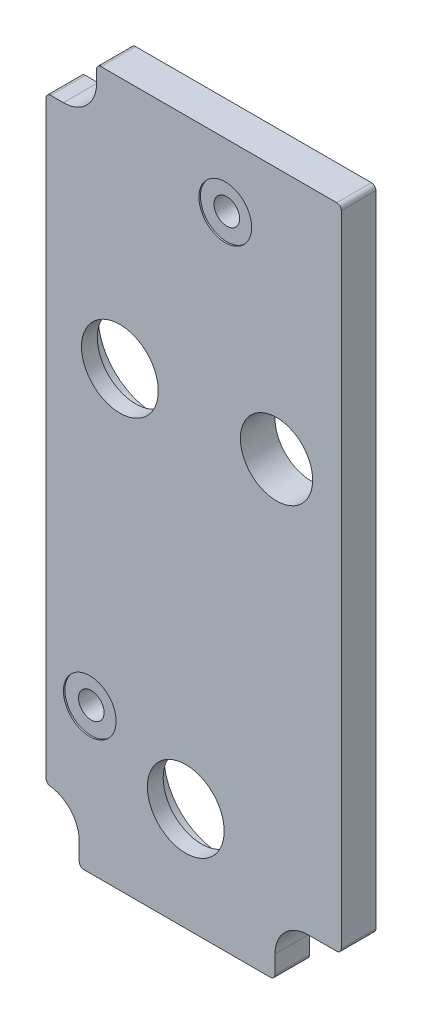
ISO-10303-21;
HEADER;
FILE_DESCRIPTION(('STEP AP214'),'2;1');
FILE_NAME('part.step','',(''),(''),'','','');
FILE_SCHEMA(('AUTOMOTIVE_DESIGN { 1 0 10303 214 1 1 1 1 }'));
ENDSEC;
DATA;
#1=APPLICATION_CONTEXT('core data for automotive mechanical design processes');
#2=APPLICATION_PROTOCOL_DEFINITION('international standard','automotive_design',2000,#1);
#3=PRODUCT_CONTEXT('',#1,'mechanical');
#4=PRODUCT('Part','Part','',(#3));
#5=PRODUCT_RELATED_PRODUCT_CATEGORY('part','',(#4));
#6=PRODUCT_DEFINITION_FORMATION('','',#4);
#7=PRODUCT_DEFINITION_CONTEXT('part definition',#1,'design');
#8=PRODUCT_DEFINITION('design','',#6,#7);
#9=PRODUCT_DEFINITION_SHAPE('','',#8);
#10=(LENGTH_UNIT() NAMED_UNIT(*) SI_UNIT(.MILLI.,.METRE.));
#11=(NAMED_UNIT(*) PLANE_ANGLE_UNIT() SI_UNIT($,.RADIAN.));
#12=(NAMED_UNIT(*) SI_UNIT($,.STERADIAN.) SOLID_ANGLE_UNIT());
#13=UNCERTAINTY_MEASURE_WITH_UNIT(LENGTH_MEASURE(1.E-05),#10,'distance_accuracy_value','');
#14=(GEOMETRIC_REPRESENTATION_CONTEXT(3) GLOBAL_UNCERTAINTY_ASSIGNED_CONTEXT((#13)) GLOBAL_UNIT_ASSIGNED_CONTEXT((#10,
#11,#12)) REPRESENTATION_CONTEXT('',''));
#15=CARTESIAN_POINT('',(0.,0.,0.));
#16=DIRECTION('',(0.,0.,1.));
#17=DIRECTION('',(1.,0.,0.));
#18=AXIS2_PLACEMENT_3D('',#15,#16,#17);
#19=CARTESIAN_POINT('',(-43.18,37.084,7.4295));
#20=DIRECTION('',(0.,0.,-1.));
#21=DIRECTION('',(-1.,0.,0.));
#22=AXIS2_PLACEMENT_3D('',#19,#20,#21);
#23=CYLINDRICAL_SURFACE('',#22,2.15900000000001);
#24=CARTESIAN_POINT('',(-43.18,37.084,1.5875));
#25=DIRECTION('',(0.,0.,-1.));
#26=DIRECTION('',(-1.,0.,0.));
#27=AXIS2_PLACEMENT_3D('',#24,#25,#26);
#28=CIRCLE('',#27,2.15900000000001);
#29=CARTESIAN_POINT('',(-45.339,37.084,1.5875));
#30=VERTEX_POINT('',#29);
#31=EDGE_CURVE('E247',#30,#30,#28,.T.);
#32=ORIENTED_EDGE('',*,*,#31,.T.);
#33=EDGE_LOOP('',(#32));
#34=FACE_BOUND('',#33,.T.);
#35=CARTESIAN_POINT('',(-43.18,37.084,7.1755));
#36=DIRECTION('',(0.,0.,-1.));
#37=DIRECTION('',(-1.,0.,0.));
#38=AXIS2_PLACEMENT_3D('',#35,#36,#37);
#39=CIRCLE('',#38,2.15900000000001);
#40=CARTESIAN_POINT('',(-45.339,37.084,7.1755));
#41=VERTEX_POINT('',#40);
#42=EDGE_CURVE('E279',#41,#41,#39,.T.);
#43=ORIENTED_EDGE('',*,*,#42,.F.);
#44=EDGE_LOOP('',(#43));
#45=FACE_BOUND('',#44,.T.);
#46=ADVANCED_FACE('F17',(#34,#45),#23,.F.);
#47=CARTESIAN_POINT('',(-20.32,120.65,7.4295));
#48=DIRECTION('',(0.,0.,-1.));
#49=DIRECTION('',(-1.,0.,0.));
#50=AXIS2_PLACEMENT_3D('',#47,#48,#49);
#51=CYLINDRICAL_SURFACE('',#50,2.159);
#52=CARTESIAN_POINT('',(-20.32,120.65,1.5875));
#53=DIRECTION('',(0.,0.,-1.));
#54=DIRECTION('',(-1.,0.,0.));
#55=AXIS2_PLACEMENT_3D('',#52,#53,#54);
#56=CIRCLE('',#55,2.159);
#57=CARTESIAN_POINT('',(-22.479,120.65,1.5875));
#58=VERTEX_POINT('',#57);
#59=EDGE_CURVE('E244',#58,#58,#56,.T.);
#60=ORIENTED_EDGE('',*,*,#59,.T.);
#61=EDGE_LOOP('',(#60));
#62=FACE_BOUND('',#61,.T.);
#63=CARTESIAN_POINT('',(-20.32,120.65,7.1755));
#64=DIRECTION('',(0.,0.,-1.));
#65=DIRECTION('',(-1.,0.,0.));
#66=AXIS2_PLACEMENT_3D('',#63,#64,#65);
#67=CIRCLE('',#66,2.159);
#68=CARTESIAN_POINT('',(-22.479,120.65,7.1755));
#69=VERTEX_POINT('',#68);
#70=EDGE_CURVE('E276',#69,#69,#67,.T.);
#71=ORIENTED_EDGE('',*,*,#70,.F.);
#72=EDGE_LOOP('',(#71));
#73=FACE_BOUND('',#72,.T.);
#74=ADVANCED_FACE('F685',(#62,#73),#51,.F.);
#75=CARTESIAN_POINT('',(-38.1,88.9,1.5875));
#76=DIRECTION('',(0.,0.,1.));
#77=DIRECTION('',(1.,0.,0.));
#78=AXIS2_PLACEMENT_3D('',#75,#76,#77);
#79=CYLINDRICAL_SURFACE('',#78,9.525);
#80=CARTESIAN_POINT('',(-38.1,88.9,4.7625));
#81=DIRECTION('',(0.,0.,1.));
#82=DIRECTION('',(1.,0.,0.));
#83=AXIS2_PLACEMENT_3D('',#80,#81,#82);
#84=CIRCLE('',#83,9.525);
#85=CARTESIAN_POINT('',(-28.575,88.9,4.7625));
#86=VERTEX_POINT('',#85);
#87=EDGE_CURVE('E270',#86,#86,#84,.F.);
#88=ORIENTED_EDGE('',*,*,#87,.F.);
#89=EDGE_LOOP('',(#88));
#90=FACE_BOUND('',#89,.T.);
#91=CARTESIAN_POINT('',(-38.1,88.9,1.5875));
#92=DIRECTION('',(0.,0.,1.));
#93=DIRECTION('',(1.,0.,0.));
#94=AXIS2_PLACEMENT_3D('',#91,#92,#93);
#95=CIRCLE('',#94,9.525);
#96=CARTESIAN_POINT('',(-28.575,88.9,1.5875));
#97=VERTEX_POINT('',#96);
#98=EDGE_CURVE('E241',#97,#97,#95,.F.);
#99=ORIENTED_EDGE('',*,*,#98,.T.);
#100=EDGE_LOOP('',(#99));
#101=FACE_BOUND('',#100,.T.);
#102=ADVANCED_FACE('F676',(#90,#101),#79,.F.);
#103=CARTESIAN_POINT('',(-26.9875,30.1625,1.5875));
#104=DIRECTION('',(0.,0.,1.));
#105=DIRECTION('',(1.,0.,0.));
#106=AXIS2_PLACEMENT_3D('',#103,#104,#105);
#107=CYLINDRICAL_SURFACE('',#106,9.525);
#108=CARTESIAN_POINT('',(-26.9875,30.1625,4.7625));
#109=DIRECTION('',(0.,0.,1.));
#110=DIRECTION('',(1.,0.,0.));
#111=AXIS2_PLACEMENT_3D('',#108,#109,#110);
#112=CIRCLE('',#111,9.525);
#113=CARTESIAN_POINT('',(-17.4625,30.1625,4.7625));
#114=VERTEX_POINT('',#113);
#115=EDGE_CURVE('E273',#114,#114,#112,.F.);
#116=ORIENTED_EDGE('',*,*,#115,.F.);
#117=EDGE_LOOP('',(#116));
#118=FACE_BOUND('',#117,.T.);
#119=CARTESIAN_POINT('',(-26.9875,30.1625,1.5875));
#120=DIRECTION('',(0.,0.,1.));
#121=DIRECTION('',(1.,0.,0.));
#122=AXIS2_PLACEMENT_3D('',#119,#120,#121);
#123=CIRCLE('',#122,9.525);
#124=CARTESIAN_POINT('',(-17.4625,30.1625,1.5875));
#125=VERTEX_POINT('',#124);
#126=EDGE_CURVE('E178',#125,#125,#123,.F.);
#127=ORIENTED_EDGE('',*,*,#126,.T.);
#128=EDGE_LOOP('',(#127));
#129=FACE_BOUND('',#128,.T.);
#130=ADVANCED_FACE('F668',(#118,#129),#107,.F.);
#131=CARTESIAN_POINT('',(-41.275,130.683,1.5875));
#132=DIRECTION('',(0.,0.,1.));
#133=DIRECTION('',(1.,0.,0.));
#134=AXIS2_PLACEMENT_3D('',#131,#132,#133);
#135=CYLINDRICAL_SURFACE('',#134,0.762);
#136=CARTESIAN_POINT('',(-41.275,130.683,1.5875));
#137=DIRECTION('',(0.,0.,1.));
#138=DIRECTION('',(1.,0.,0.));
#139=AXIS2_PLACEMENT_3D('',#136,#137,#138);
#140=CIRCLE('',#139,0.762);
#141=CARTESIAN_POINT('',(-41.275,131.445,1.5875));
#142=VERTEX_POINT('',#141);
#143=CARTESIAN_POINT('',(-42.037,130.683,1.5875));
#144=VERTEX_POINT('',#143);
#145=EDGE_CURVE('E268',#142,#144,#140,.T.);
#146=ORIENTED_EDGE('',*,*,#145,.T.);
#147=DIRECTION('',(0.,0.,1.));
#148=VECTOR('',#147,1.);
#149=CARTESIAN_POINT('',(-42.037,130.683,1.5875));
#150=LINE('',#149,#148);
#151=CARTESIAN_POINT('',(-42.037,130.683,7.4295));
#152=VERTEX_POINT('',#151);
#153=EDGE_CURVE('E94',#152,#144,#150,.F.);
#154=ORIENTED_EDGE('',*,*,#153,.F.);
#155=CARTESIAN_POINT('',(-41.275,130.683,7.4295));
#156=DIRECTION('',(0.,0.,1.));
#157=DIRECTION('',(1.,0.,0.));
#158=AXIS2_PLACEMENT_3D('',#155,#156,#157);
#159=CIRCLE('',#158,0.762);
#160=CARTESIAN_POINT('',(-41.275,131.445,7.4295));
#161=VERTEX_POINT('',#160);
#162=EDGE_CURVE('E20',#152,#161,#159,.F.);
#163=ORIENTED_EDGE('',*,*,#162,.T.);
#164=DIRECTION('',(0.,0.,1.));
#165=VECTOR('',#164,1.);
#166=CARTESIAN_POINT('',(-41.275,131.445,1.5875));
#167=LINE('',#166,#165);
#168=EDGE_CURVE('E91',#142,#161,#167,.T.);
#169=ORIENTED_EDGE('',*,*,#168,.F.);
#170=EDGE_LOOP('',(#146,#154,#163,#169));
#171=FACE_BOUND('',#170,.T.);
#172=ADVANCED_FACE('F89',(#171),#135,.T.);
#173=CARTESIAN_POINT('',(-49.784,122.2375,1.5875));
#174=DIRECTION('',(0.,0.,1.));
#175=DIRECTION('',(1.,0.,0.));
#176=AXIS2_PLACEMENT_3D('',#173,#174,#175);
#177=CYLINDRICAL_SURFACE('',#176,0.762);
#178=CARTESIAN_POINT('',(-49.784,122.2375,1.5875));
#179=DIRECTION('',(0.,0.,1.));
#180=DIRECTION('',(1.,0.,0.));
#181=AXIS2_PLACEMENT_3D('',#178,#179,#180);
#182=CIRCLE('',#181,0.762);
#183=CARTESIAN_POINT('',(-49.784,122.9995,1.5875));
#184=VERTEX_POINT('',#183);
#185=CARTESIAN_POINT('',(-50.546,122.2375,1.5875));
#186=VERTEX_POINT('',#185);
#187=EDGE_CURVE('E265',#184,#186,#182,.T.);
#188=ORIENTED_EDGE('',*,*,#187,.T.);
#189=DIRECTION('',(0.,0.,1.));
#190=VECTOR('',#189,1.);
#191=CARTESIAN_POINT('',(-50.546,122.2375,1.5875));
#192=LINE('',#191,#190);
#193=CARTESIAN_POINT('',(-50.546,122.2375,7.4295));
#194=VERTEX_POINT('',#193);
#195=EDGE_CURVE('E158',#194,#186,#192,.F.);
#196=ORIENTED_EDGE('',*,*,#195,.F.);
#197=CARTESIAN_POINT('',(-49.784,122.2375,7.4295));
#198=DIRECTION('',(0.,0.,1.));
#199=DIRECTION('',(1.,0.,0.));
#200=AXIS2_PLACEMENT_3D('',#197,#198,#199);
#201=CIRCLE('',#200,0.762);
#202=CARTESIAN_POINT('',(-49.784,122.9995,7.4295));
#203=VERTEX_POINT('',#202);
#204=EDGE_CURVE('E96',#194,#203,#201,.F.);
#205=ORIENTED_EDGE('',*,*,#204,.T.);
#206=DIRECTION('',(0.,0.,1.));
#207=VECTOR('',#206,1.);
#208=CARTESIAN_POINT('',(-49.784,122.9995,1.5875));
#209=LINE('',#208,#207);
#210=EDGE_CURVE('E169',#184,#203,#209,.T.);
#211=ORIENTED_EDGE('',*,*,#210,.F.);
#212=EDGE_LOOP('',(#188,#196,#205,#211));
#213=FACE_BOUND('',#212,.T.);
#214=ADVANCED_FACE('F292',(#213),#177,.T.);
#215=CARTESIAN_POINT('',(-49.784,22.8141142121634,1.5875));
#216=DIRECTION('',(0.,0.,1.));
#217=DIRECTION('',(1.,0.,0.));
#218=AXIS2_PLACEMENT_3D('',#215,#216,#217);
#219=CYLINDRICAL_SURFACE('',#218,0.762);
#220=CARTESIAN_POINT('',(-49.784,22.8141142121634,1.5875));
#221=DIRECTION('',(0.,0.,1.));
#222=DIRECTION('',(1.,0.,0.));
#223=AXIS2_PLACEMENT_3D('',#220,#221,#222);
#224=CIRCLE('',#223,0.762);
#225=CARTESIAN_POINT('',(-50.546,22.8141142121634,1.5875));
#226=VERTEX_POINT('',#225);
#227=CARTESIAN_POINT('',(-49.87544,22.0576205067037,1.5875));
#228=VERTEX_POINT('',#227);
#229=EDGE_CURVE('E262',#226,#228,#224,.T.);
#230=ORIENTED_EDGE('',*,*,#229,.T.);
#231=DIRECTION('',(0.,0.,1.));
#232=VECTOR('',#231,1.);
#233=CARTESIAN_POINT('',(-49.87544,22.0576205067038,1.5875));
#234=LINE('',#233,#232);
#235=CARTESIAN_POINT('',(-49.87544,22.0576205067037,7.4295));
#236=VERTEX_POINT('',#235);
#237=EDGE_CURVE('E154',#228,#236,#234,.T.);
#238=ORIENTED_EDGE('',*,*,#237,.T.);
#239=CARTESIAN_POINT('',(-49.784,22.8141142121634,7.4295));
#240=DIRECTION('',(0.,0.,1.));
#241=DIRECTION('',(1.,0.,0.));
#242=AXIS2_PLACEMENT_3D('',#239,#240,#241);
#243=CIRCLE('',#242,0.762);
#244=CARTESIAN_POINT('',(-50.546,22.8141142121634,7.4295));
#245=VERTEX_POINT('',#244);
#246=EDGE_CURVE('E288',#236,#245,#243,.F.);
#247=ORIENTED_EDGE('',*,*,#246,.T.);
#248=DIRECTION('',(0.,0.,1.));
#249=VECTOR('',#248,1.);
#250=CARTESIAN_POINT('',(-50.546,22.8141142121634,1.5875));
#251=LINE('',#250,#249);
#252=EDGE_CURVE('E163',#226,#245,#251,.T.);
#253=ORIENTED_EDGE('',*,*,#252,.F.);
#254=EDGE_LOOP('',(#230,#238,#247,#253));
#255=FACE_BOUND('',#254,.T.);
#256=ADVANCED_FACE('F409',(#255),#219,.T.);
#257=CARTESIAN_POINT('',(-44.196,13.462,1.5875));
#258=DIRECTION('',(0.,0.,1.));
#259=DIRECTION('',(1.,0.,0.));
#260=AXIS2_PLACEMENT_3D('',#257,#258,#259);
#261=CYLINDRICAL_SURFACE('',#260,0.762);
#262=CARTESIAN_POINT('',(-44.196,13.462,1.5875));
#263=DIRECTION('',(0.,0.,1.));
#264=DIRECTION('',(1.,0.,0.));
#265=AXIS2_PLACEMENT_3D('',#262,#263,#264);
#266=CIRCLE('',#265,0.762);
#267=CARTESIAN_POINT('',(-44.958,13.462,1.5875));
#268=VERTEX_POINT('',#267);
#269=CARTESIAN_POINT('',(-44.196,12.7,1.5875));
#270=VERTEX_POINT('',#269);
#271=EDGE_CURVE('E259',#268,#270,#266,.T.);
#272=ORIENTED_EDGE('',*,*,#271,.T.);
#273=DIRECTION('',(0.,0.,1.));
#274=VECTOR('',#273,1.);
#275=CARTESIAN_POINT('',(-44.196,12.7,1.5875));
#276=LINE('',#275,#274);
#277=CARTESIAN_POINT('',(-44.196,12.7,7.4295));
#278=VERTEX_POINT('',#277);
#279=EDGE_CURVE('E141',#278,#270,#276,.F.);
#280=ORIENTED_EDGE('',*,*,#279,.F.);
#281=CARTESIAN_POINT('',(-44.196,13.462,7.4295));
#282=DIRECTION('',(0.,0.,1.));
#283=DIRECTION('',(1.,0.,0.));
#284=AXIS2_PLACEMENT_3D('',#281,#282,#283);
#285=CIRCLE('',#284,0.762);
#286=CARTESIAN_POINT('',(-44.958,13.462,7.4295));
#287=VERTEX_POINT('',#286);
#288=EDGE_CURVE('E286',#278,#287,#285,.F.);
#289=ORIENTED_EDGE('',*,*,#288,.T.);
#290=DIRECTION('',(0.,0.,1.));
#291=VECTOR('',#290,1.);
#292=CARTESIAN_POINT('',(-44.958,13.462,1.5875));
#293=LINE('',#292,#291);
#294=EDGE_CURVE('E151',#268,#287,#293,.T.);
#295=ORIENTED_EDGE('',*,*,#294,.F.);
#296=EDGE_LOOP('',(#272,#280,#289,#295));
#297=FACE_BOUND('',#296,.T.);
#298=ADVANCED_FACE('F397',(#297),#261,.T.);
#299=CARTESIAN_POINT('',(-12.7,13.462,1.5875));
#300=DIRECTION('',(0.,0.,1.));
#301=DIRECTION('',(1.,0.,0.));
#302=AXIS2_PLACEMENT_3D('',#299,#300,#301);
#303=CYLINDRICAL_SURFACE('',#302,0.762);
#304=CARTESIAN_POINT('',(-12.7,13.462,1.5875));
#305=DIRECTION('',(0.,0.,1.));
#306=DIRECTION('',(1.,0.,0.));
#307=AXIS2_PLACEMENT_3D('',#304,#305,#306);
#308=CIRCLE('',#307,0.762);
#309=CARTESIAN_POINT('',(-12.7,12.7,1.5875));
#310=VERTEX_POINT('',#309);
#311=CARTESIAN_POINT('',(-11.938,13.462,1.5875));
#312=VERTEX_POINT('',#311);
#313=EDGE_CURVE('E256',#310,#312,#308,.T.);
#314=ORIENTED_EDGE('',*,*,#313,.T.);
#315=DIRECTION('',(0.,0.,1.));
#316=VECTOR('',#315,1.);
#317=CARTESIAN_POINT('',(-11.938,13.462,1.5875));
#318=LINE('',#317,#316);
#319=CARTESIAN_POINT('',(-11.938,13.462,7.4295));
#320=VERTEX_POINT('',#319);
#321=EDGE_CURVE('E137',#320,#312,#318,.F.);
#322=ORIENTED_EDGE('',*,*,#321,.F.);
#323=CARTESIAN_POINT('',(-12.7,13.462,7.4295));
#324=DIRECTION('',(0.,0.,1.));
#325=DIRECTION('',(1.,0.,0.));
#326=AXIS2_PLACEMENT_3D('',#323,#324,#325);
#327=CIRCLE('',#326,0.762);
#328=CARTESIAN_POINT('',(-12.7,12.7,7.4295));
#329=VERTEX_POINT('',#328);
#330=EDGE_CURVE('E284',#320,#329,#327,.F.);
#331=ORIENTED_EDGE('',*,*,#330,.T.);
#332=DIRECTION('',(0.,0.,1.));
#333=VECTOR('',#332,1.);
#334=CARTESIAN_POINT('',(-12.7,12.7,1.5875));
#335=LINE('',#334,#333);
#336=EDGE_CURVE('E140',#310,#329,#335,.T.);
#337=ORIENTED_EDGE('',*,*,#336,.F.);
#338=EDGE_LOOP('',(#314,#322,#331,#337));
#339=FACE_BOUND('',#338,.T.);
#340=ADVANCED_FACE('F389',(#339),#303,.T.);
#341=CARTESIAN_POINT('',(-1.52399999999998,130.683,1.5875));
#342=DIRECTION('',(0.,0.,1.));
#343=DIRECTION('',(1.,0.,0.));
#344=AXIS2_PLACEMENT_3D('',#341,#342,#343);
#345=CYLINDRICAL_SURFACE('',#344,0.762);
#346=CARTESIAN_POINT('',(-1.52399999999998,130.683,1.5875));
#347=DIRECTION('',(0.,0.,1.));
#348=DIRECTION('',(1.,0.,0.));
#349=AXIS2_PLACEMENT_3D('',#346,#347,#348);
#350=CIRCLE('',#349,0.762);
#351=CARTESIAN_POINT('',(-0.761999999999984,130.683,1.5875));
#352=VERTEX_POINT('',#351);
#353=CARTESIAN_POINT('',(-1.52399999999998,131.445,1.5875));
#354=VERTEX_POINT('',#353);
#355=EDGE_CURVE('E250',#352,#354,#350,.T.);
#356=ORIENTED_EDGE('',*,*,#355,.T.);
#357=DIRECTION('',(0.,0.,1.));
#358=VECTOR('',#357,1.);
#359=CARTESIAN_POINT('',(-1.52399999999998,131.445,1.5875));
#360=LINE('',#359,#358);
#361=CARTESIAN_POINT('',(-1.52399999999998,131.445,7.4295));
#362=VERTEX_POINT('',#361);
#363=EDGE_CURVE('E177',#362,#354,#360,.F.);
#364=ORIENTED_EDGE('',*,*,#363,.F.);
#365=CARTESIAN_POINT('',(-1.52399999999998,130.683,7.4295));
#366=DIRECTION('',(0.,0.,1.));
#367=DIRECTION('',(1.,0.,0.));
#368=AXIS2_PLACEMENT_3D('',#365,#366,#367);
#369=CIRCLE('',#368,0.762);
#370=CARTESIAN_POINT('',(-0.761999999999991,130.683,7.4295));
#371=VERTEX_POINT('',#370);
#372=EDGE_CURVE('E106',#362,#371,#369,.F.);
#373=ORIENTED_EDGE('',*,*,#372,.T.);
#374=DIRECTION('',(0.,0.,1.));
#375=VECTOR('',#374,1.);
#376=CARTESIAN_POINT('',(-0.761999999999984,130.683,1.5875));
#377=LINE('',#376,#375);
#378=EDGE_CURVE('E122',#352,#371,#377,.T.);
#379=ORIENTED_EDGE('',*,*,#378,.F.);
#380=EDGE_LOOP('',(#356,#364,#373,#379));
#381=FACE_BOUND('',#380,.T.);
#382=ADVANCED_FACE('F321',(#381),#345,.T.);
#383=CARTESIAN_POINT('',(-1.524,22.86,1.5875));
#384=DIRECTION('',(0.,0.,1.));
#385=DIRECTION('',(1.,0.,0.));
#386=AXIS2_PLACEMENT_3D('',#383,#384,#385);
#387=CYLINDRICAL_SURFACE('',#386,0.762);
#388=CARTESIAN_POINT('',(-1.524,22.86,1.5875));
#389=DIRECTION('',(0.,0.,1.));
#390=DIRECTION('',(1.,0.,0.));
#391=AXIS2_PLACEMENT_3D('',#388,#389,#390);
#392=CIRCLE('',#391,0.762);
#393=CARTESIAN_POINT('',(-1.524,22.098,1.5875));
#394=VERTEX_POINT('',#393);
#395=CARTESIAN_POINT('',(-0.761999999999997,22.86,1.5875));
#396=VERTEX_POINT('',#395);
#397=EDGE_CURVE('E253',#394,#396,#392,.T.);
#398=ORIENTED_EDGE('',*,*,#397,.T.);
#399=DIRECTION('',(0.,0.,1.));
#400=VECTOR('',#399,1.);
#401=CARTESIAN_POINT('',(-0.761999999999997,22.86,1.5875));
#402=LINE('',#401,#400);
#403=CARTESIAN_POINT('',(-0.761999999999998,22.86,7.4295));
#404=VERTEX_POINT('',#403);
#405=EDGE_CURVE('E118',#404,#396,#402,.F.);
#406=ORIENTED_EDGE('',*,*,#405,.F.);
#407=CARTESIAN_POINT('',(-1.524,22.86,7.4295));
#408=DIRECTION('',(0.,0.,1.));
#409=DIRECTION('',(1.,0.,0.));
#410=AXIS2_PLACEMENT_3D('',#407,#408,#409);
#411=CIRCLE('',#410,0.762);
#412=CARTESIAN_POINT('',(-1.524,22.098,7.4295));
#413=VERTEX_POINT('',#412);
#414=EDGE_CURVE('E35',#404,#413,#411,.F.);
#415=ORIENTED_EDGE('',*,*,#414,.T.);
#416=DIRECTION('',(0.,0.,-1.));
#417=VECTOR('',#416,1.);
#418=CARTESIAN_POINT('',(-1.524,22.098,1.5875));
#419=LINE('',#418,#417);
#420=EDGE_CURVE('E129',#394,#413,#419,.F.);
#421=ORIENTED_EDGE('',*,*,#420,.F.);
#422=EDGE_LOOP('',(#398,#406,#415,#421));
#423=FACE_BOUND('',#422,.T.);
#424=ADVANCED_FACE('F616',(#423),#387,.T.);
#425=CARTESIAN_POINT('',(-43.18,37.084,7.1755));
#426=DIRECTION('',(0.,0.,1.));
#427=DIRECTION('',(1.,0.,0.));
#428=AXIS2_PLACEMENT_3D('',#425,#426,#427);
#429=PLANE('',#428);
#430=ORIENTED_EDGE('',*,*,#42,.T.);
#431=EDGE_LOOP('',(#430));
#432=FACE_BOUND('',#431,.T.);
#433=CARTESIAN_POINT('',(-43.18,37.084,7.1755));
#434=DIRECTION('',(0.,0.,-1.));
#435=DIRECTION('',(-1.,0.,0.));
#436=AXIS2_PLACEMENT_3D('',#433,#434,#435);
#437=CIRCLE('',#436,4.445);
#438=CARTESIAN_POINT('',(-47.625,37.084,7.1755));
#439=VERTEX_POINT('',#438);
#440=EDGE_CURVE('E182',#439,#439,#437,.F.);
#441=ORIENTED_EDGE('',*,*,#440,.T.);
#442=EDGE_LOOP('',(#441));
#443=FACE_BOUND('',#442,.T.);
#444=ADVANCED_FACE('F607',(#432,#443),#429,.T.);
#445=CARTESIAN_POINT('',(-20.32,120.65,7.1755));
#446=DIRECTION('',(0.,0.,1.));
#447=DIRECTION('',(1.,0.,0.));
#448=AXIS2_PLACEMENT_3D('',#445,#446,#447);
#449=PLANE('',#448);
#450=ORIENTED_EDGE('',*,*,#70,.T.);
#451=EDGE_LOOP('',(#450));
#452=FACE_BOUND('',#451,.T.);
#453=CARTESIAN_POINT('',(-20.32,120.65,7.1755));
#454=DIRECTION('',(0.,0.,-1.));
#455=DIRECTION('',(-1.,0.,0.));
#456=AXIS2_PLACEMENT_3D('',#453,#454,#455);
#457=CIRCLE('',#456,4.445);
#458=CARTESIAN_POINT('',(-24.765,120.65,7.1755));
#459=VERTEX_POINT('',#458);
#460=EDGE_CURVE('E228',#459,#459,#457,.F.);
#461=ORIENTED_EDGE('',*,*,#460,.T.);
#462=EDGE_LOOP('',(#461));
#463=FACE_BOUND('',#462,.T.);
#464=ADVANCED_FACE('F598',(#452,#463),#449,.T.);
#465=CARTESIAN_POINT('',(-26.9875,30.1625,4.7625));
#466=DIRECTION('',(0.,0.,-1.));
#467=DIRECTION('',(-1.,0.,0.));
#468=AXIS2_PLACEMENT_3D('',#465,#466,#467);
#469=PLANE('',#468);
#470=CARTESIAN_POINT('',(-26.9875,30.1625,4.7625));
#471=DIRECTION('',(0.,0.,-1.));
#472=DIRECTION('',(-1.,0.,0.));
#473=AXIS2_PLACEMENT_3D('',#470,#471,#472);
#474=CIRCLE('',#473,6.477);
#475=CARTESIAN_POINT('',(-33.4645,30.1625,4.7625));
#476=VERTEX_POINT('',#475);
#477=EDGE_CURVE('E225',#476,#476,#474,.F.);
#478=ORIENTED_EDGE('',*,*,#477,.T.);
#479=EDGE_LOOP('',(#478));
#480=FACE_BOUND('',#479,.T.);
#481=ORIENTED_EDGE('',*,*,#115,.T.);
#482=EDGE_LOOP('',(#481));
#483=FACE_BOUND('',#482,.T.);
#484=ADVANCED_FACE('F589',(#480,#483),#469,.T.);
#485=CARTESIAN_POINT('',(-38.1,88.9,4.7625));
#486=DIRECTION('',(0.,0.,-1.));
#487=DIRECTION('',(-1.,0.,0.));
#488=AXIS2_PLACEMENT_3D('',#485,#486,#487);
#489=PLANE('',#488);
#490=CARTESIAN_POINT('',(-38.1,88.9,4.7625));
#491=DIRECTION('',(0.,0.,-1.));
#492=DIRECTION('',(-1.,0.,0.));
#493=AXIS2_PLACEMENT_3D('',#490,#491,#492);
#494=CIRCLE('',#493,6.477);
#495=CARTESIAN_POINT('',(-44.577,88.9,4.7625));
#496=VERTEX_POINT('',#495);
#497=EDGE_CURVE('E114',#496,#496,#494,.F.);
#498=ORIENTED_EDGE('',*,*,#497,.T.);
#499=EDGE_LOOP('',(#498));
#500=FACE_BOUND('',#499,.T.);
#501=ORIENTED_EDGE('',*,*,#87,.T.);
#502=EDGE_LOOP('',(#501));
#503=FACE_BOUND('',#502,.T.);
#504=ADVANCED_FACE('F580',(#500,#503),#489,.T.);
#505=CARTESIAN_POINT('',(-29.7059047619048,82.55,1.5875));
#506=DIRECTION('',(0.,0.,1.));
#507=DIRECTION('',(1.,0.,0.));
#508=AXIS2_PLACEMENT_3D('',#505,#506,#507);
#509=PLANE('',#508);
#510=CARTESIAN_POINT('',(-11.684,88.9,1.5875));
#511=DIRECTION('',(0.,0.,-1.));
#512=DIRECTION('',(-1.,0.,0.));
#513=AXIS2_PLACEMENT_3D('',#510,#511,#512);
#514=CIRCLE('',#513,6.096);
#515=CARTESIAN_POINT('',(-17.78,88.9,1.5875));
#516=VERTEX_POINT('',#515);
#517=EDGE_CURVE('E109',#516,#516,#514,.F.);
#518=ORIENTED_EDGE('',*,*,#517,.T.);
#519=EDGE_LOOP('',(#518));
#520=FACE_BOUND('',#519,.T.);
#521=ORIENTED_EDGE('',*,*,#126,.F.);
#522=EDGE_LOOP('',(#521));
#523=FACE_BOUND('',#522,.T.);
#524=ORIENTED_EDGE('',*,*,#98,.F.);
#525=EDGE_LOOP('',(#524));
#526=FACE_BOUND('',#525,.T.);
#527=ORIENTED_EDGE('',*,*,#59,.F.);
#528=EDGE_LOOP('',(#527));
#529=FACE_BOUND('',#528,.T.);
#530=ORIENTED_EDGE('',*,*,#31,.F.);
#531=EDGE_LOOP('',(#530));
#532=FACE_BOUND('',#531,.T.);
#533=DIRECTION('',(0.,1.,0.));
#534=VECTOR('',#533,1.);
#535=CARTESIAN_POINT('',(-0.761999999999997,22.098,1.5875));
#536=LINE('',#535,#534);
#537=EDGE_CURVE('E121',#396,#352,#536,.T.);
#538=ORIENTED_EDGE('',*,*,#537,.F.);
#539=ORIENTED_EDGE('',*,*,#397,.F.);
#540=DIRECTION('',(1.,0.,0.));
#541=VECTOR('',#540,1.);
#542=CARTESIAN_POINT('',(-6.35,22.098,1.5875));
#543=LINE('',#542,#541);
#544=CARTESIAN_POINT('',(-6.35,22.098,1.5875));
#545=VERTEX_POINT('',#544);
#546=EDGE_CURVE('E125',#545,#394,#543,.T.);
#547=ORIENTED_EDGE('',*,*,#546,.F.);
#548=CARTESIAN_POINT('',(-6.35,16.51,1.5875));
#549=DIRECTION('',(0.,0.,1.));
#550=DIRECTION('',(1.,0.,0.));
#551=AXIS2_PLACEMENT_3D('',#548,#549,#550);
#552=CIRCLE('',#551,5.588);
#553=CARTESIAN_POINT('',(-11.938,16.51,1.5875));
#554=VERTEX_POINT('',#553);
#555=EDGE_CURVE('E132',#545,#554,#552,.T.);
#556=ORIENTED_EDGE('',*,*,#555,.T.);
#557=DIRECTION('',(0.,1.,0.));
#558=VECTOR('',#557,1.);
#559=CARTESIAN_POINT('',(-11.938,12.7,1.5875));
#560=LINE('',#559,#558);
#561=EDGE_CURVE('E136',#312,#554,#560,.T.);
#562=ORIENTED_EDGE('',*,*,#561,.F.);
#563=ORIENTED_EDGE('',*,*,#313,.F.);
#564=DIRECTION('',(1.,0.,0.));
#565=VECTOR('',#564,1.);
#566=CARTESIAN_POINT('',(-44.958,12.7,1.5875));
#567=LINE('',#566,#565);
#568=EDGE_CURVE('E144',#270,#310,#567,.T.);
#569=ORIENTED_EDGE('',*,*,#568,.F.);
#570=ORIENTED_EDGE('',*,*,#271,.F.);
#571=DIRECTION('',(0.,1.,0.));
#572=VECTOR('',#571,1.);
#573=CARTESIAN_POINT('',(-44.958,16.51,1.5875));
#574=LINE('',#573,#572);
#575=CARTESIAN_POINT('',(-44.958,16.51,1.5875));
#576=VERTEX_POINT('',#575);
#577=EDGE_CURVE('E145',#576,#268,#574,.F.);
#578=ORIENTED_EDGE('',*,*,#577,.F.);
#579=CARTESIAN_POINT('',(-50.546,16.51,1.5875));
#580=DIRECTION('',(0.,0.,1.));
#581=DIRECTION('',(1.,0.,0.));
#582=AXIS2_PLACEMENT_3D('',#579,#580,#581);
#583=CIRCLE('',#582,5.588);
#584=EDGE_CURVE('E157',#576,#228,#583,.T.);
#585=ORIENTED_EDGE('',*,*,#584,.T.);
#586=ORIENTED_EDGE('',*,*,#229,.F.);
#587=DIRECTION('',(0.,1.,0.));
#588=VECTOR('',#587,1.);
#589=CARTESIAN_POINT('',(-50.546,122.9995,1.5875));
#590=LINE('',#589,#588);
#591=EDGE_CURVE('E161',#186,#226,#590,.F.);
#592=ORIENTED_EDGE('',*,*,#591,.F.);
#593=ORIENTED_EDGE('',*,*,#187,.F.);
#594=DIRECTION('',(-1.,0.,0.));
#595=VECTOR('',#594,1.);
#596=CARTESIAN_POINT('',(-47.625,122.9995,1.5875));
#597=LINE('',#596,#595);
#598=CARTESIAN_POINT('',(-47.6250000000001,122.9995,1.5875));
#599=VERTEX_POINT('',#598);
#600=EDGE_CURVE('E162',#599,#184,#597,.T.);
#601=ORIENTED_EDGE('',*,*,#600,.F.);
#602=CARTESIAN_POINT('',(-47.625,128.5875,1.5875));
#603=DIRECTION('',(0.,0.,1.));
#604=DIRECTION('',(1.,0.,0.));
#605=AXIS2_PLACEMENT_3D('',#602,#603,#604);
#606=CIRCLE('',#605,5.58799999999995);
#607=CARTESIAN_POINT('',(-42.037,128.5875,1.5875));
#608=VERTEX_POINT('',#607);
#609=EDGE_CURVE('E172',#599,#608,#606,.T.);
#610=ORIENTED_EDGE('',*,*,#609,.T.);
#611=DIRECTION('',(0.,1.,0.));
#612=VECTOR('',#611,1.);
#613=CARTESIAN_POINT('',(-42.037,131.445,1.5875));
#614=LINE('',#613,#612);
#615=EDGE_CURVE('E175',#144,#608,#614,.F.);
#616=ORIENTED_EDGE('',*,*,#615,.F.);
#617=ORIENTED_EDGE('',*,*,#145,.F.);
#618=DIRECTION('',(1.,0.,0.));
#619=VECTOR('',#618,1.);
#620=CARTESIAN_POINT('',(-0.761999999999982,131.445,1.5875));
#621=LINE('',#620,#619);
#622=EDGE_CURVE('E103',#354,#142,#621,.F.);
#623=ORIENTED_EDGE('',*,*,#622,.F.);
#624=ORIENTED_EDGE('',*,*,#355,.F.);
#625=EDGE_LOOP('',(#538,#539,#547,#556,#562,#563,#569,#570,#578,#585,#586,#592,#593,#601,#610,
#616,#617,#623,#624));
#626=FACE_BOUND('',#625,.T.);
#627=ADVANCED_FACE('F326',(#520,#523,#526,#529,#532,#626),#509,.F.);
#628=CARTESIAN_POINT('',(-0.761999999999982,131.445,1.5875));
#629=DIRECTION('',(0.,1.,0.));
#630=DIRECTION('',(0.,0.,1.));
#631=AXIS2_PLACEMENT_3D('',#628,#629,#630);
#632=PLANE('',#631);
#633=ORIENTED_EDGE('',*,*,#168,.T.);
#634=DIRECTION('',(1.,0.,0.));
#635=VECTOR('',#634,1.);
#636=CARTESIAN_POINT('',(-29.7059047619048,131.445,7.4295));
#637=LINE('',#636,#635);
#638=EDGE_CURVE('E101',#362,#161,#637,.F.);
#639=ORIENTED_EDGE('',*,*,#638,.F.);
#640=ORIENTED_EDGE('',*,*,#363,.T.);
#641=ORIENTED_EDGE('',*,*,#622,.T.);
#642=EDGE_LOOP('',(#633,#639,#640,#641));
#643=FACE_BOUND('',#642,.T.);
#644=ADVANCED_FACE('F99',(#643),#632,.T.);
#645=CARTESIAN_POINT('',(-42.037,131.445,1.5875));
#646=DIRECTION('',(-1.,0.,0.));
#647=DIRECTION('',(0.,0.,1.));
#648=AXIS2_PLACEMENT_3D('',#645,#646,#647);
#649=PLANE('',#648);
#650=DIRECTION('',(0.,0.,1.));
#651=VECTOR('',#650,1.);
#652=CARTESIAN_POINT('',(-42.0370000000001,128.5875,1.5875));
#653=LINE('',#652,#651);
#654=CARTESIAN_POINT('',(-42.037,128.5875,7.4295));
#655=VERTEX_POINT('',#654);
#656=EDGE_CURVE('E173',#608,#655,#653,.T.);
#657=ORIENTED_EDGE('',*,*,#656,.T.);
#658=DIRECTION('',(0.,1.,0.));
#659=VECTOR('',#658,1.);
#660=CARTESIAN_POINT('',(-42.037,82.55,7.4295));
#661=LINE('',#660,#659);
#662=EDGE_CURVE('E108',#152,#655,#661,.F.);
#663=ORIENTED_EDGE('',*,*,#662,.F.);
#664=ORIENTED_EDGE('',*,*,#153,.T.);
#665=ORIENTED_EDGE('',*,*,#615,.T.);
#666=EDGE_LOOP('',(#657,#663,#664,#665));
#667=FACE_BOUND('',#666,.T.);
#668=ADVANCED_FACE('F367',(#667),#649,.T.);
#669=CARTESIAN_POINT('',(-47.625,128.5875,1.5875));
#670=DIRECTION('',(0.,0.,1.));
#671=DIRECTION('',(1.,0.,0.));
#672=AXIS2_PLACEMENT_3D('',#669,#670,#671);
#673=CYLINDRICAL_SURFACE('',#672,5.58799999999995);
#674=DIRECTION('',(0.,0.,1.));
#675=VECTOR('',#674,1.);
#676=CARTESIAN_POINT('',(-47.625,122.9995,1.5875));
#677=LINE('',#676,#675);
#678=CARTESIAN_POINT('',(-47.625,122.9995,7.4295));
#679=VERTEX_POINT('',#678);
#680=EDGE_CURVE('E166',#679,#599,#677,.F.);
#681=ORIENTED_EDGE('',*,*,#680,.F.);
#682=CARTESIAN_POINT('',(-47.625,128.5875,7.4295));
#683=DIRECTION('',(0.,0.,1.));
#684=DIRECTION('',(1.,0.,0.));
#685=AXIS2_PLACEMENT_3D('',#682,#683,#684);
#686=CIRCLE('',#685,5.58799999999995);
#687=EDGE_CURVE('E111',#655,#679,#686,.F.);
#688=ORIENTED_EDGE('',*,*,#687,.F.);
#689=ORIENTED_EDGE('',*,*,#656,.F.);
#690=ORIENTED_EDGE('',*,*,#609,.F.);
#691=EDGE_LOOP('',(#681,#688,#689,#690));
#692=FACE_BOUND('',#691,.T.);
#693=ADVANCED_FACE('F368',(#692),#673,.F.);
#694=CARTESIAN_POINT('',(-47.625,122.9995,1.5875));
#695=DIRECTION('',(0.,1.,0.));
#696=DIRECTION('',(-1.,0.,0.));
#697=AXIS2_PLACEMENT_3D('',#694,#695,#696);
#698=PLANE('',#697);
#699=ORIENTED_EDGE('',*,*,#680,.T.);
#700=ORIENTED_EDGE('',*,*,#600,.T.);
#701=ORIENTED_EDGE('',*,*,#210,.T.);
#702=DIRECTION('',(1.,0.,0.));
#703=VECTOR('',#702,1.);
#704=CARTESIAN_POINT('',(-29.7059047619048,122.9995,7.4295));
#705=LINE('',#704,#703);
#706=EDGE_CURVE('E221',#679,#203,#705,.F.);
#707=ORIENTED_EDGE('',*,*,#706,.F.);
#708=EDGE_LOOP('',(#699,#700,#701,#707));
#709=FACE_BOUND('',#708,.T.);
#710=ADVANCED_FACE('F300',(#709),#698,.T.);
#711=CARTESIAN_POINT('',(-50.546,122.9995,1.5875));
#712=DIRECTION('',(-1.,0.,0.));
#713=DIRECTION('',(0.,0.,1.));
#714=AXIS2_PLACEMENT_3D('',#711,#712,#713);
#715=PLANE('',#714);
#716=ORIENTED_EDGE('',*,*,#252,.T.);
#717=DIRECTION('',(0.,1.,0.));
#718=VECTOR('',#717,1.);
#719=CARTESIAN_POINT('',(-50.546,82.55,7.4295));
#720=LINE('',#719,#718);
#721=EDGE_CURVE('E219',#194,#245,#720,.F.);
#722=ORIENTED_EDGE('',*,*,#721,.F.);
#723=ORIENTED_EDGE('',*,*,#195,.T.);
#724=ORIENTED_EDGE('',*,*,#591,.T.);
#725=EDGE_LOOP('',(#716,#722,#723,#724));
#726=FACE_BOUND('',#725,.T.);
#727=ADVANCED_FACE('F411',(#726),#715,.T.);
#728=CARTESIAN_POINT('',(-50.546,16.51,1.5875));
#729=DIRECTION('',(0.,0.,1.));
#730=DIRECTION('',(1.,0.,0.));
#731=AXIS2_PLACEMENT_3D('',#728,#729,#730);
#732=CYLINDRICAL_SURFACE('',#731,5.588);
#733=ORIENTED_EDGE('',*,*,#584,.F.);
#734=DIRECTION('',(0.,0.,1.));
#735=VECTOR('',#734,1.);
#736=CARTESIAN_POINT('',(-44.958,16.51,1.5875));
#737=LINE('',#736,#735);
#738=CARTESIAN_POINT('',(-44.958,16.51,7.4295));
#739=VERTEX_POINT('',#738);
#740=EDGE_CURVE('E148',#739,#576,#737,.F.);
#741=ORIENTED_EDGE('',*,*,#740,.F.);
#742=CARTESIAN_POINT('',(-50.546,16.51,7.4295));
#743=DIRECTION('',(0.,0.,1.));
#744=DIRECTION('',(1.,0.,0.));
#745=AXIS2_PLACEMENT_3D('',#742,#743,#744);
#746=CIRCLE('',#745,5.588);
#747=EDGE_CURVE('E215',#236,#739,#746,.F.);
#748=ORIENTED_EDGE('',*,*,#747,.F.);
#749=ORIENTED_EDGE('',*,*,#237,.F.);
#750=EDGE_LOOP('',(#733,#741,#748,#749));
#751=FACE_BOUND('',#750,.T.);
#752=ADVANCED_FACE('F406',(#751),#732,.F.);
#753=CARTESIAN_POINT('',(-44.958,16.51,1.5875));
#754=DIRECTION('',(-1.,0.,0.));
#755=DIRECTION('',(0.,0.,1.));
#756=AXIS2_PLACEMENT_3D('',#753,#754,#755);
#757=PLANE('',#756);
#758=ORIENTED_EDGE('',*,*,#740,.T.);
#759=ORIENTED_EDGE('',*,*,#577,.T.);
#760=ORIENTED_EDGE('',*,*,#294,.T.);
#761=DIRECTION('',(0.,1.,0.));
#762=VECTOR('',#761,1.);
#763=CARTESIAN_POINT('',(-44.958,82.55,7.4295));
#764=LINE('',#763,#762);
#765=EDGE_CURVE('E218',#739,#287,#764,.F.);
#766=ORIENTED_EDGE('',*,*,#765,.F.);
#767=EDGE_LOOP('',(#758,#759,#760,#766));
#768=FACE_BOUND('',#767,.T.);
#769=ADVANCED_FACE('F400',(#768),#757,.T.);
#770=CARTESIAN_POINT('',(-44.958,12.7,1.5875));
#771=DIRECTION('',(0.,-1.,0.));
#772=DIRECTION('',(1.,0.,0.));
#773=AXIS2_PLACEMENT_3D('',#770,#771,#772);
#774=PLANE('',#773);
#775=ORIENTED_EDGE('',*,*,#336,.T.);
#776=DIRECTION('',(1.,0.,0.));
#777=VECTOR('',#776,1.);
#778=CARTESIAN_POINT('',(-29.7059047619048,12.7,7.4295));
#779=LINE('',#778,#777);
#780=EDGE_CURVE('E307',#278,#329,#779,.T.);
#781=ORIENTED_EDGE('',*,*,#780,.F.);
#782=ORIENTED_EDGE('',*,*,#279,.T.);
#783=ORIENTED_EDGE('',*,*,#568,.T.);
#784=EDGE_LOOP('',(#775,#781,#782,#783));
#785=FACE_BOUND('',#784,.T.);
#786=ADVANCED_FACE('F395',(#785),#774,.T.);
#787=CARTESIAN_POINT('',(-11.938,12.7,1.5875));
#788=DIRECTION('',(1.,0.,0.));
#789=DIRECTION('',(0.,1.,0.));
#790=AXIS2_PLACEMENT_3D('',#787,#788,#789);
#791=PLANE('',#790);
#792=DIRECTION('',(0.,0.,1.));
#793=VECTOR('',#792,1.);
#794=CARTESIAN_POINT('',(-11.938,16.51,1.5875));
#795=LINE('',#794,#793);
#796=CARTESIAN_POINT('',(-11.938,16.51,7.4295));
#797=VERTEX_POINT('',#796);
#798=EDGE_CURVE('E133',#554,#797,#795,.T.);
#799=ORIENTED_EDGE('',*,*,#798,.T.);
#800=DIRECTION('',(0.,1.,0.));
#801=VECTOR('',#800,1.);
#802=CARTESIAN_POINT('',(-11.938,82.55,7.4295));
#803=LINE('',#802,#801);
#804=EDGE_CURVE('E214',#320,#797,#803,.T.);
#805=ORIENTED_EDGE('',*,*,#804,.F.);
#806=ORIENTED_EDGE('',*,*,#321,.T.);
#807=ORIENTED_EDGE('',*,*,#561,.T.);
#808=EDGE_LOOP('',(#799,#805,#806,#807));
#809=FACE_BOUND('',#808,.T.);
#810=ADVANCED_FACE('F375',(#809),#791,.T.);
#811=CARTESIAN_POINT('',(-6.35,16.51,1.5875));
#812=DIRECTION('',(0.,0.,1.));
#813=DIRECTION('',(1.,0.,0.));
#814=AXIS2_PLACEMENT_3D('',#811,#812,#813);
#815=CYLINDRICAL_SURFACE('',#814,5.588);
#816=DIRECTION('',(0.,0.,-1.));
#817=VECTOR('',#816,1.);
#818=CARTESIAN_POINT('',(-6.35,22.098,1.5875));
#819=LINE('',#818,#817);
#820=CARTESIAN_POINT('',(-6.35,22.098,7.4295));
#821=VERTEX_POINT('',#820);
#822=EDGE_CURVE('E126',#821,#545,#819,.T.);
#823=ORIENTED_EDGE('',*,*,#822,.F.);
#824=CARTESIAN_POINT('',(-6.35,16.51,7.4295));
#825=DIRECTION('',(0.,0.,1.));
#826=DIRECTION('',(1.,0.,0.));
#827=AXIS2_PLACEMENT_3D('',#824,#825,#826);
#828=CIRCLE('',#827,5.588);
#829=EDGE_CURVE('E210',#797,#821,#828,.F.);
#830=ORIENTED_EDGE('',*,*,#829,.F.);
#831=ORIENTED_EDGE('',*,*,#798,.F.);
#832=ORIENTED_EDGE('',*,*,#555,.F.);
#833=EDGE_LOOP('',(#823,#830,#831,#832));
#834=FACE_BOUND('',#833,.T.);
#835=ADVANCED_FACE('F383',(#834),#815,.F.);
#836=CARTESIAN_POINT('',(-6.35,22.098,1.5875));
#837=DIRECTION('',(0.,-1.,0.));
#838=DIRECTION('',(0.,0.,-1.));
#839=AXIS2_PLACEMENT_3D('',#836,#837,#838);
#840=PLANE('',#839);
#841=ORIENTED_EDGE('',*,*,#822,.T.);
#842=ORIENTED_EDGE('',*,*,#546,.T.);
#843=ORIENTED_EDGE('',*,*,#420,.T.);
#844=DIRECTION('',(1.,0.,0.));
#845=VECTOR('',#844,1.);
#846=CARTESIAN_POINT('',(-29.7059047619048,22.098,7.4295));
#847=LINE('',#846,#845);
#848=EDGE_CURVE('E213',#821,#413,#847,.T.);
#849=ORIENTED_EDGE('',*,*,#848,.F.);
#850=EDGE_LOOP('',(#841,#842,#843,#849));
#851=FACE_BOUND('',#850,.T.);
#852=ADVANCED_FACE('F450',(#851),#840,.T.);
#853=CARTESIAN_POINT('',(-0.761999999999997,22.098,1.5875));
#854=DIRECTION('',(1.,0.,0.));
#855=DIRECTION('',(0.,1.,0.));
#856=AXIS2_PLACEMENT_3D('',#853,#854,#855);
#857=PLANE('',#856);
#858=ORIENTED_EDGE('',*,*,#405,.T.);
#859=ORIENTED_EDGE('',*,*,#537,.T.);
#860=ORIENTED_EDGE('',*,*,#378,.T.);
#861=DIRECTION('',(0.,1.,0.));
#862=VECTOR('',#861,1.);
#863=CARTESIAN_POINT('',(-0.761999999999999,82.55,7.4295));
#864=LINE('',#863,#862);
#865=EDGE_CURVE('E209',#404,#371,#864,.T.);
#866=ORIENTED_EDGE('',*,*,#865,.F.);
#867=EDGE_LOOP('',(#858,#859,#860,#866));
#868=FACE_BOUND('',#867,.T.);
#869=ADVANCED_FACE('F315',(#868),#857,.T.);
#870=CARTESIAN_POINT('',(-43.18,37.084,7.4295));
#871=DIRECTION('',(0.,0.,-1.));
#872=DIRECTION('',(-1.,0.,0.));
#873=AXIS2_PLACEMENT_3D('',#870,#871,#872);
#874=CYLINDRICAL_SURFACE('',#873,4.445);
#875=ORIENTED_EDGE('',*,*,#440,.F.);
#876=EDGE_LOOP('',(#875));
#877=FACE_BOUND('',#876,.T.);
#878=CARTESIAN_POINT('',(-43.18,37.084,7.4295));
#879=DIRECTION('',(0.,0.,-1.));
#880=DIRECTION('',(-1.,0.,0.));
#881=AXIS2_PLACEMENT_3D('',#878,#879,#880);
#882=CIRCLE('',#881,4.445);
#883=CARTESIAN_POINT('',(-47.625,37.084,7.4295));
#884=VERTEX_POINT('',#883);
#885=EDGE_CURVE('E206',#884,#884,#882,.T.);
#886=ORIENTED_EDGE('',*,*,#885,.F.);
#887=EDGE_LOOP('',(#886));
#888=FACE_BOUND('',#887,.T.);
#889=ADVANCED_FACE('F443',(#877,#888),#874,.F.);
#890=CARTESIAN_POINT('',(-20.32,120.65,7.4295));
#891=DIRECTION('',(0.,0.,-1.));
#892=DIRECTION('',(-1.,0.,0.));
#893=AXIS2_PLACEMENT_3D('',#890,#891,#892);
#894=CYLINDRICAL_SURFACE('',#893,4.445);
#895=ORIENTED_EDGE('',*,*,#460,.F.);
#896=EDGE_LOOP('',(#895));
#897=FACE_BOUND('',#896,.T.);
#898=CARTESIAN_POINT('',(-20.32,120.65,7.4295));
#899=DIRECTION('',(0.,0.,-1.));
#900=DIRECTION('',(-1.,0.,0.));
#901=AXIS2_PLACEMENT_3D('',#898,#899,#900);
#902=CIRCLE('',#901,4.445);
#903=CARTESIAN_POINT('',(-24.765,120.65,7.4295));
#904=VERTEX_POINT('',#903);
#905=EDGE_CURVE('E203',#904,#904,#902,.T.);
#906=ORIENTED_EDGE('',*,*,#905,.F.);
#907=EDGE_LOOP('',(#906));
#908=FACE_BOUND('',#907,.T.);
#909=ADVANCED_FACE('F439',(#897,#908),#894,.F.);
#910=CARTESIAN_POINT('',(-26.9875,30.1625,7.4295));
#911=DIRECTION('',(0.,0.,-1.));
#912=DIRECTION('',(-1.,0.,0.));
#913=AXIS2_PLACEMENT_3D('',#910,#911,#912);
#914=CYLINDRICAL_SURFACE('',#913,6.477);
#915=ORIENTED_EDGE('',*,*,#477,.F.);
#916=EDGE_LOOP('',(#915));
#917=FACE_BOUND('',#916,.T.);
#918=CARTESIAN_POINT('',(-26.9875,30.1625,7.4295));
#919=DIRECTION('',(0.,0.,-1.));
#920=DIRECTION('',(-1.,0.,0.));
#921=AXIS2_PLACEMENT_3D('',#918,#919,#920);
#922=CIRCLE('',#921,6.477);
#923=CARTESIAN_POINT('',(-33.4645,30.1625,7.4295));
#924=VERTEX_POINT('',#923);
#925=EDGE_CURVE('E200',#924,#924,#922,.T.);
#926=ORIENTED_EDGE('',*,*,#925,.F.);
#927=EDGE_LOOP('',(#926));
#928=FACE_BOUND('',#927,.T.);
#929=ADVANCED_FACE('F435',(#917,#928),#914,.F.);
#930=CARTESIAN_POINT('',(-38.1,88.9,7.4295));
#931=DIRECTION('',(0.,0.,-1.));
#932=DIRECTION('',(-1.,0.,0.));
#933=AXIS2_PLACEMENT_3D('',#930,#931,#932);
#934=CYLINDRICAL_SURFACE('',#933,6.477);
#935=ORIENTED_EDGE('',*,*,#497,.F.);
#936=EDGE_LOOP('',(#935));
#937=FACE_BOUND('',#936,.T.);
#938=CARTESIAN_POINT('',(-38.1,88.9,7.4295));
#939=DIRECTION('',(0.,0.,-1.));
#940=DIRECTION('',(-1.,0.,0.));
#941=AXIS2_PLACEMENT_3D('',#938,#939,#940);
#942=CIRCLE('',#941,6.477);
#943=CARTESIAN_POINT('',(-44.577,88.9,7.4295));
#944=VERTEX_POINT('',#943);
#945=EDGE_CURVE('E26',#944,#944,#942,.T.);
#946=ORIENTED_EDGE('',*,*,#945,.F.);
#947=EDGE_LOOP('',(#946));
#948=FACE_BOUND('',#947,.T.);
#949=ADVANCED_FACE('F428',(#937,#948),#934,.F.);
#950=CARTESIAN_POINT('',(-11.684,88.9,7.4295));
#951=DIRECTION('',(0.,0.,-1.));
#952=DIRECTION('',(-1.,0.,0.));
#953=AXIS2_PLACEMENT_3D('',#950,#951,#952);
#954=CYLINDRICAL_SURFACE('',#953,6.096);
#955=ORIENTED_EDGE('',*,*,#517,.F.);
#956=EDGE_LOOP('',(#955));
#957=FACE_BOUND('',#956,.T.);
#958=CARTESIAN_POINT('',(-11.684,88.9,7.4295));
#959=DIRECTION('',(0.,0.,-1.));
#960=DIRECTION('',(-1.,0.,0.));
#961=AXIS2_PLACEMENT_3D('',#958,#959,#960);
#962=CIRCLE('',#961,6.096);
#963=CARTESIAN_POINT('',(-17.78,88.9,7.4295));
#964=VERTEX_POINT('',#963);
#965=EDGE_CURVE('E11',#964,#964,#962,.T.);
#966=ORIENTED_EDGE('',*,*,#965,.F.);
#967=EDGE_LOOP('',(#966));
#968=FACE_BOUND('',#967,.T.);
#969=ADVANCED_FACE('F422',(#957,#968),#954,.F.);
#970=CARTESIAN_POINT('',(-29.7059047619048,82.55,7.4295));
#971=DIRECTION('',(0.,0.,1.));
#972=DIRECTION('',(1.,0.,0.));
#973=AXIS2_PLACEMENT_3D('',#970,#971,#972);
#974=PLANE('',#973);
#975=ORIENTED_EDGE('',*,*,#965,.T.);
#976=EDGE_LOOP('',(#975));
#977=FACE_BOUND('',#976,.T.);
#978=ORIENTED_EDGE('',*,*,#945,.T.);
#979=EDGE_LOOP('',(#978));
#980=FACE_BOUND('',#979,.T.);
#981=ORIENTED_EDGE('',*,*,#925,.T.);
#982=EDGE_LOOP('',(#981));
#983=FACE_BOUND('',#982,.T.);
#984=ORIENTED_EDGE('',*,*,#905,.T.);
#985=EDGE_LOOP('',(#984));
#986=FACE_BOUND('',#985,.T.);
#987=ORIENTED_EDGE('',*,*,#885,.T.);
#988=EDGE_LOOP('',(#987));
#989=FACE_BOUND('',#988,.T.);
#990=ORIENTED_EDGE('',*,*,#414,.F.);
#991=ORIENTED_EDGE('',*,*,#865,.T.);
#992=ORIENTED_EDGE('',*,*,#372,.F.);
#993=ORIENTED_EDGE('',*,*,#638,.T.);
#994=ORIENTED_EDGE('',*,*,#162,.F.);
#995=ORIENTED_EDGE('',*,*,#662,.T.);
#996=ORIENTED_EDGE('',*,*,#687,.T.);
#997=ORIENTED_EDGE('',*,*,#706,.T.);
#998=ORIENTED_EDGE('',*,*,#204,.F.);
#999=ORIENTED_EDGE('',*,*,#721,.T.);
#1000=ORIENTED_EDGE('',*,*,#246,.F.);
#1001=ORIENTED_EDGE('',*,*,#747,.T.);
#1002=ORIENTED_EDGE('',*,*,#765,.T.);
#1003=ORIENTED_EDGE('',*,*,#288,.F.);
#1004=ORIENTED_EDGE('',*,*,#780,.T.);
#1005=ORIENTED_EDGE('',*,*,#330,.F.);
#1006=ORIENTED_EDGE('',*,*,#804,.T.);
#1007=ORIENTED_EDGE('',*,*,#829,.T.);
#1008=ORIENTED_EDGE('',*,*,#848,.T.);
#1009=EDGE_LOOP('',(#990,#991,#992,#993,#994,#995,#996,#997,#998,#999,#1000,#1001,#1002,#1003,
#1004,#1005,#1006,#1007,#1008));
#1010=FACE_BOUND('',#1009,.T.);
#1011=ADVANCED_FACE('F105',(#977,#980,#983,#986,#989,#1010),#974,.T.);
#1012=CLOSED_SHELL('',(#46,#74,#102,#130,#172,#214,#256,#298,#340,#382,#424,#444,#464,#484,#504,
#627,#644,#668,#693,#710,#727,#752,#769,#786,#810,#835,#852,#869,#889,#909,#929,#949,#969,#1011));
#1013=MANIFOLD_SOLID_BREP('B1',#1012);
#1014=ADVANCED_BREP_SHAPE_REPRESENTATION('',(#18,#1013),#14);
#1015=SHAPE_DEFINITION_REPRESENTATION(#9,#1014);
ENDSEC;
END-ISO-10303-21;
